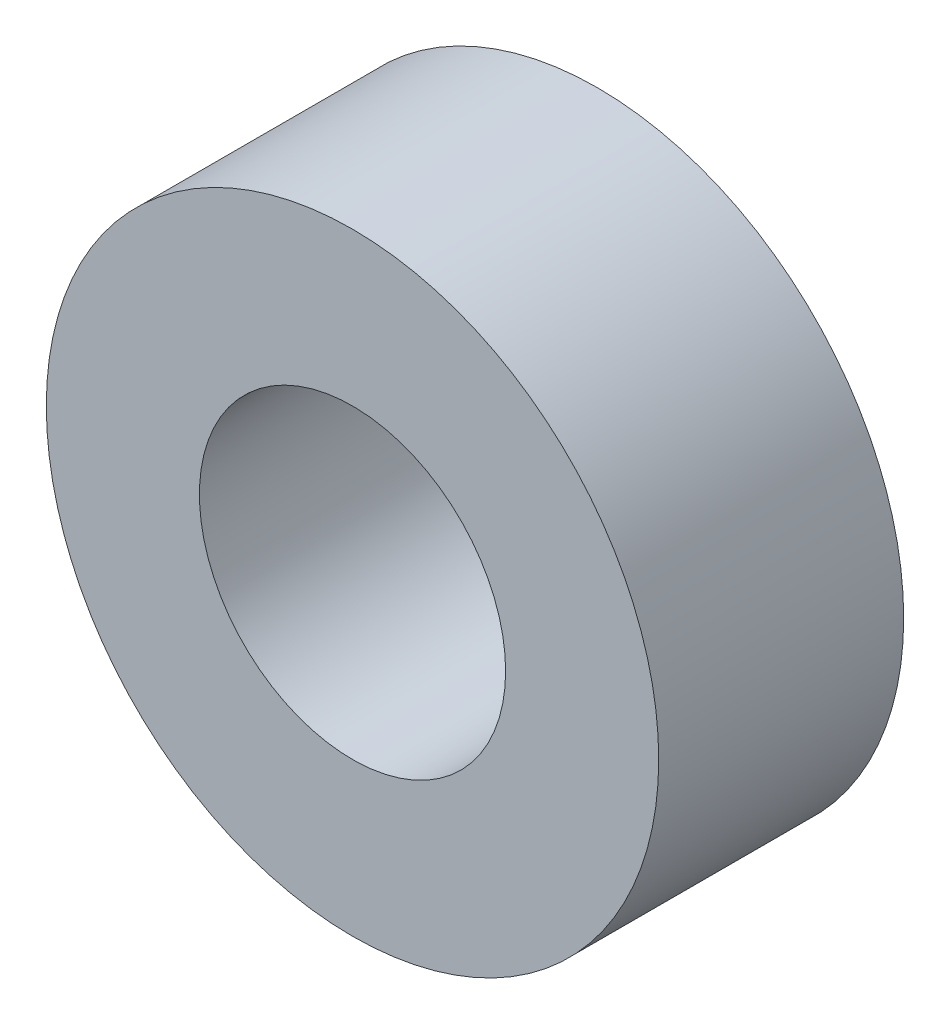
ISO-10303-21;
HEADER;
FILE_DESCRIPTION(('STEP AP214'),'2;1');
FILE_NAME('part.step','',(''),(''),'','','');
FILE_SCHEMA(('AUTOMOTIVE_DESIGN { 1 0 10303 214 1 1 1 1 }'));
ENDSEC;
DATA;
#1=APPLICATION_CONTEXT('core data for automotive mechanical design processes');
#2=APPLICATION_PROTOCOL_DEFINITION('international standard','automotive_design',2000,#1);
#3=PRODUCT_CONTEXT('',#1,'mechanical');
#4=PRODUCT('Part','Part','',(#3));
#5=PRODUCT_RELATED_PRODUCT_CATEGORY('part','',(#4));
#6=PRODUCT_DEFINITION_FORMATION('','',#4);
#7=PRODUCT_DEFINITION_CONTEXT('part definition',#1,'design');
#8=PRODUCT_DEFINITION('design','',#6,#7);
#9=PRODUCT_DEFINITION_SHAPE('','',#8);
#10=(LENGTH_UNIT() NAMED_UNIT(*) SI_UNIT(.MILLI.,.METRE.));
#11=(NAMED_UNIT(*) PLANE_ANGLE_UNIT() SI_UNIT($,.RADIAN.));
#12=(NAMED_UNIT(*) SI_UNIT($,.STERADIAN.) SOLID_ANGLE_UNIT());
#13=UNCERTAINTY_MEASURE_WITH_UNIT(LENGTH_MEASURE(1.E-05),#10,'distance_accuracy_value','');
#14=(GEOMETRIC_REPRESENTATION_CONTEXT(3) GLOBAL_UNCERTAINTY_ASSIGNED_CONTEXT((#13)) GLOBAL_UNIT_ASSIGNED_CONTEXT((#10,
#11,#12)) REPRESENTATION_CONTEXT('',''));
#15=CARTESIAN_POINT('',(0.,0.,0.));
#16=DIRECTION('',(0.,0.,1.));
#17=DIRECTION('',(1.,0.,0.));
#18=AXIS2_PLACEMENT_3D('',#15,#16,#17);
#19=CARTESIAN_POINT('',(0.,0.,4.));
#20=DIRECTION('',(0.,0.,1.));
#21=DIRECTION('',(1.,0.,0.));
#22=AXIS2_PLACEMENT_3D('',#19,#20,#21);
#23=PLANE('',#22);
#24=CARTESIAN_POINT('',(0.,0.,4.));
#25=DIRECTION('',(0.,0.,1.));
#26=DIRECTION('',(1.,0.,0.));
#27=AXIS2_PLACEMENT_3D('',#24,#25,#26);
#28=CIRCLE('',#27,5.);
#29=CARTESIAN_POINT('',(5.,0.,4.));
#30=VERTEX_POINT('',#29);
#31=EDGE_CURVE('E10',#30,#30,#28,.T.);
#32=ORIENTED_EDGE('',*,*,#31,.T.);
#33=EDGE_LOOP('',(#32));
#34=FACE_BOUND('',#33,.T.);
#35=CARTESIAN_POINT('',(0.,0.,4.));
#36=DIRECTION('',(0.,0.,1.));
#37=DIRECTION('',(1.,0.,0.));
#38=AXIS2_PLACEMENT_3D('',#35,#36,#37);
#39=CIRCLE('',#38,2.5);
#40=CARTESIAN_POINT('',(2.5,0.,4.));
#41=VERTEX_POINT('',#40);
#42=EDGE_CURVE('E46',#41,#41,#39,.T.);
#43=ORIENTED_EDGE('',*,*,#42,.F.);
#44=EDGE_LOOP('',(#43));
#45=FACE_BOUND('',#44,.T.);
#46=ADVANCED_FACE('F35',(#34,#45),#23,.T.);
#47=CARTESIAN_POINT('',(0.,0.,0.));
#48=DIRECTION('',(0.,0.,1.));
#49=DIRECTION('',(1.,0.,0.));
#50=AXIS2_PLACEMENT_3D('',#47,#48,#49);
#51=PLANE('',#50);
#52=CARTESIAN_POINT('',(0.,0.,0.));
#53=DIRECTION('',(0.,0.,1.));
#54=DIRECTION('',(1.,0.,0.));
#55=AXIS2_PLACEMENT_3D('',#52,#53,#54);
#56=CIRCLE('',#55,5.);
#57=CARTESIAN_POINT('',(5.,0.,0.));
#58=VERTEX_POINT('',#57);
#59=EDGE_CURVE('E39',#58,#58,#56,.T.);
#60=ORIENTED_EDGE('',*,*,#59,.F.);
#61=EDGE_LOOP('',(#60));
#62=FACE_BOUND('',#61,.T.);
#63=CARTESIAN_POINT('',(0.,0.,0.));
#64=DIRECTION('',(0.,0.,1.));
#65=DIRECTION('',(1.,0.,0.));
#66=AXIS2_PLACEMENT_3D('',#63,#64,#65);
#67=CIRCLE('',#66,2.5);
#68=CARTESIAN_POINT('',(2.5,0.,0.));
#69=VERTEX_POINT('',#68);
#70=EDGE_CURVE('E48',#69,#69,#67,.T.);
#71=ORIENTED_EDGE('',*,*,#70,.T.);
#72=EDGE_LOOP('',(#71));
#73=FACE_BOUND('',#72,.T.);
#74=ADVANCED_FACE('F58',(#62,#73),#51,.F.);
#75=CARTESIAN_POINT('',(0.,0.,4.));
#76=DIRECTION('',(0.,0.,-1.));
#77=DIRECTION('',(-1.,0.,0.));
#78=AXIS2_PLACEMENT_3D('',#75,#76,#77);
#79=CYLINDRICAL_SURFACE('',#78,5.);
#80=ORIENTED_EDGE('',*,*,#31,.F.);
#81=EDGE_LOOP('',(#80));
#82=FACE_BOUND('',#81,.T.);
#83=ORIENTED_EDGE('',*,*,#59,.T.);
#84=EDGE_LOOP('',(#83));
#85=FACE_BOUND('',#84,.T.);
#86=ADVANCED_FACE('F37',(#82,#85),#79,.T.);
#87=CARTESIAN_POINT('',(0.,0.,4.));
#88=DIRECTION('',(0.,0.,-1.));
#89=DIRECTION('',(-1.,0.,0.));
#90=AXIS2_PLACEMENT_3D('',#87,#88,#89);
#91=CYLINDRICAL_SURFACE('',#90,2.5);
#92=ORIENTED_EDGE('',*,*,#42,.T.);
#93=EDGE_LOOP('',(#92));
#94=FACE_BOUND('',#93,.T.);
#95=ORIENTED_EDGE('',*,*,#70,.F.);
#96=EDGE_LOOP('',(#95));
#97=FACE_BOUND('',#96,.T.);
#98=ADVANCED_FACE('F54',(#94,#97),#91,.F.);
#99=CLOSED_SHELL('',(#46,#74,#86,#98));
#100=MANIFOLD_SOLID_BREP('B2',#99);
#101=ADVANCED_BREP_SHAPE_REPRESENTATION('',(#18,#100),#14);
#102=SHAPE_DEFINITION_REPRESENTATION(#9,#101);
ENDSEC;
END-ISO-10303-21;
